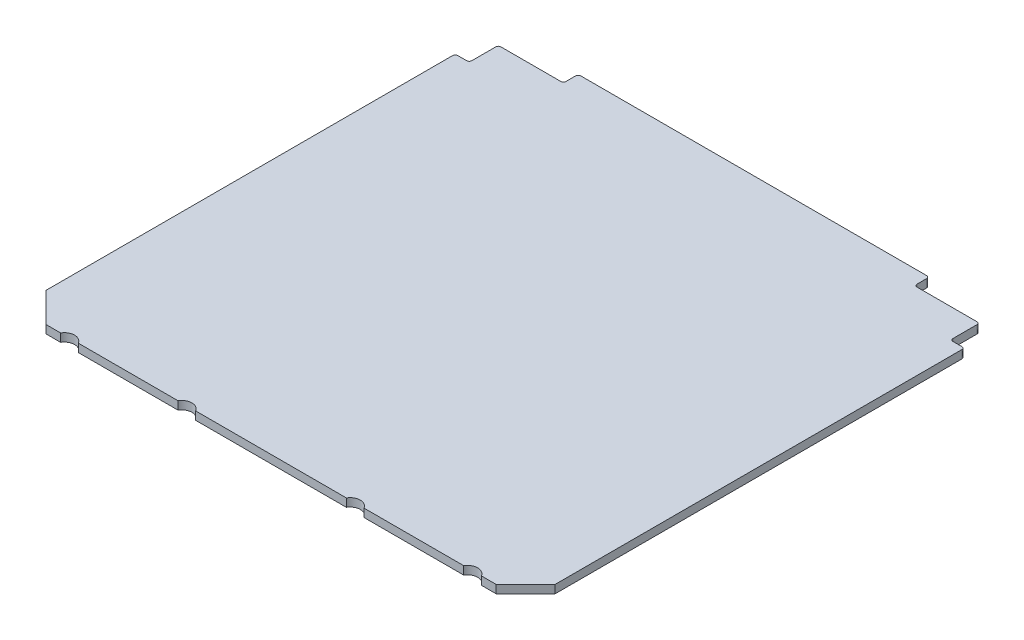
ISO-10303-21;
HEADER;
FILE_DESCRIPTION(('STEP AP214'),'2;1');
FILE_NAME('part.step','',(''),(''),'','','');
FILE_SCHEMA(('AUTOMOTIVE_DESIGN { 1 0 10303 214 1 1 1 1 }'));
ENDSEC;
DATA;
#1=APPLICATION_CONTEXT('core data for automotive mechanical design processes');
#2=APPLICATION_PROTOCOL_DEFINITION('international standard','automotive_design',2000,#1);
#3=PRODUCT_CONTEXT('',#1,'mechanical');
#4=PRODUCT('Part','Part','',(#3));
#5=PRODUCT_RELATED_PRODUCT_CATEGORY('part','',(#4));
#6=PRODUCT_DEFINITION_FORMATION('','',#4);
#7=PRODUCT_DEFINITION_CONTEXT('part definition',#1,'design');
#8=PRODUCT_DEFINITION('design','',#6,#7);
#9=PRODUCT_DEFINITION_SHAPE('','',#8);
#10=(LENGTH_UNIT() NAMED_UNIT(*) SI_UNIT(.MILLI.,.METRE.));
#11=(NAMED_UNIT(*) PLANE_ANGLE_UNIT() SI_UNIT($,.RADIAN.));
#12=(NAMED_UNIT(*) SI_UNIT($,.STERADIAN.) SOLID_ANGLE_UNIT());
#13=UNCERTAINTY_MEASURE_WITH_UNIT(LENGTH_MEASURE(1.E-05),#10,'distance_accuracy_value','');
#14=(GEOMETRIC_REPRESENTATION_CONTEXT(3) GLOBAL_UNCERTAINTY_ASSIGNED_CONTEXT((#13)) GLOBAL_UNIT_ASSIGNED_CONTEXT((#10,
#11,#12)) REPRESENTATION_CONTEXT('',''));
#15=CARTESIAN_POINT('',(0.,0.,0.));
#16=DIRECTION('',(0.,0.,1.));
#17=DIRECTION('',(1.,0.,0.));
#18=AXIS2_PLACEMENT_3D('',#15,#16,#17);
#19=CARTESIAN_POINT('',(-44.4499999999997,0.8,44.4500000000004));
#20=DIRECTION('',(0.707106781186542,0.,-0.707106781186553));
#21=DIRECTION('',(-0.707106781186553,0.,-0.707106781186542));
#22=AXIS2_PLACEMENT_3D('',#19,#20,#21);
#23=PLANE('',#22);
#24=DIRECTION('',(0.,1.,0.));
#25=VECTOR('',#24,1.);
#26=CARTESIAN_POINT('',(-44.1000000000001,-0.8,44.8));
#27=LINE('',#26,#25);
#28=CARTESIAN_POINT('',(-44.1000000000001,-0.8,44.8));
#29=VERTEX_POINT('',#28);
#30=CARTESIAN_POINT('',(-44.1000000000001,0.8,44.8));
#31=VERTEX_POINT('',#30);
#32=EDGE_CURVE('E249',#29,#31,#27,.T.);
#33=ORIENTED_EDGE('',*,*,#32,.T.);
#34=DIRECTION('',(0.707106781186553,0.,0.707106781186542));
#35=VECTOR('',#34,1.);
#36=CARTESIAN_POINT('',(-44.4499999999997,0.8,44.4500000000004));
#37=LINE('',#36,#35);
#38=CARTESIAN_POINT('',(-49.9000000000001,0.8,39.));
#39=VERTEX_POINT('',#38);
#40=EDGE_CURVE('E264',#39,#31,#37,.T.);
#41=ORIENTED_EDGE('',*,*,#40,.F.);
#42=DIRECTION('',(0.,1.,0.));
#43=VECTOR('',#42,1.);
#44=CARTESIAN_POINT('',(-49.9000000000001,-0.8,39.));
#45=LINE('',#44,#43);
#46=CARTESIAN_POINT('',(-49.9000000000001,-0.8,39.));
#47=VERTEX_POINT('',#46);
#48=EDGE_CURVE('E282',#47,#39,#45,.T.);
#49=ORIENTED_EDGE('',*,*,#48,.F.);
#50=DIRECTION('',(0.707106781186553,0.,0.707106781186542));
#51=VECTOR('',#50,1.);
#52=CARTESIAN_POINT('',(-44.4499999999997,-0.8,44.4500000000004));
#53=LINE('',#52,#51);
#54=EDGE_CURVE('E266',#47,#29,#53,.T.);
#55=ORIENTED_EDGE('',*,*,#54,.T.);
#56=EDGE_LOOP('',(#33,#41,#49,#55));
#57=FACE_BOUND('',#56,.T.);
#58=ADVANCED_FACE('F37',(#57),#23,.F.);
#59=CARTESIAN_POINT('',(44.4499999999995,0.8,44.4499999999995));
#60=DIRECTION('',(-0.707106781186548,0.,-0.707106781186548));
#61=DIRECTION('',(-0.707106781186548,0.,0.707106781186548));
#62=AXIS2_PLACEMENT_3D('',#59,#60,#61);
#63=PLANE('',#62);
#64=DIRECTION('',(0.,1.,0.));
#65=VECTOR('',#64,1.);
#66=CARTESIAN_POINT('',(44.0999999999991,-0.8,44.8));
#67=LINE('',#66,#65);
#68=CARTESIAN_POINT('',(44.0999999999991,-0.8,44.8));
#69=VERTEX_POINT('',#68);
#70=CARTESIAN_POINT('',(44.0999999999991,0.8,44.8));
#71=VERTEX_POINT('',#70);
#72=EDGE_CURVE('E267',#69,#71,#67,.T.);
#73=ORIENTED_EDGE('',*,*,#72,.F.);
#74=DIRECTION('',(0.707106781186548,0.,-0.707106781186548));
#75=VECTOR('',#74,1.);
#76=CARTESIAN_POINT('',(44.4499999999995,-0.8,44.4499999999995));
#77=LINE('',#76,#75);
#78=CARTESIAN_POINT('',(49.9000000000001,-0.8,38.999999999999));
#79=VERTEX_POINT('',#78);
#80=EDGE_CURVE('E276',#69,#79,#77,.T.);
#81=ORIENTED_EDGE('',*,*,#80,.T.);
#82=DIRECTION('',(0.,1.,0.));
#83=VECTOR('',#82,1.);
#84=CARTESIAN_POINT('',(49.9000000000001,-0.8,38.999999999999));
#85=LINE('',#84,#83);
#86=CARTESIAN_POINT('',(49.9000000000001,0.8,38.999999999999));
#87=VERTEX_POINT('',#86);
#88=EDGE_CURVE('E285',#79,#87,#85,.T.);
#89=ORIENTED_EDGE('',*,*,#88,.T.);
#90=DIRECTION('',(0.707106781186548,0.,-0.707106781186548));
#91=VECTOR('',#90,1.);
#92=CARTESIAN_POINT('',(44.4499999999995,0.8,44.4499999999995));
#93=LINE('',#92,#91);
#94=EDGE_CURVE('E275',#71,#87,#93,.T.);
#95=ORIENTED_EDGE('',*,*,#94,.F.);
#96=EDGE_LOOP('',(#73,#81,#89,#95));
#97=FACE_BOUND('',#96,.T.);
#98=ADVANCED_FACE('F561',(#97),#63,.F.);
#99=CARTESIAN_POINT('',(0.,0.8,0.));
#100=DIRECTION('',(0.,1.,0.));
#101=DIRECTION('',(0.,0.,1.));
#102=AXIS2_PLACEMENT_3D('',#99,#100,#101);
#103=PLANE('',#102);
#104=DIRECTION('',(0.,0.,-1.));
#105=VECTOR('',#104,1.);
#106=CARTESIAN_POINT('',(34.3999999999997,0.8,0.));
#107=LINE('',#106,#105);
#108=CARTESIAN_POINT('',(34.3999999999997,0.8,-47.4));
#109=VERTEX_POINT('',#108);
#110=CARTESIAN_POINT('',(34.3999999999997,0.8,-49.3));
#111=VERTEX_POINT('',#110);
#112=EDGE_CURVE('E410',#109,#111,#107,.T.);
#113=ORIENTED_EDGE('',*,*,#112,.T.);
#114=CARTESIAN_POINT('',(33.8999999999997,0.8,-49.3));
#115=DIRECTION('',(0.,1.,0.));
#116=DIRECTION('',(0.,0.,1.));
#117=AXIS2_PLACEMENT_3D('',#114,#115,#116);
#118=CIRCLE('',#117,0.5);
#119=CARTESIAN_POINT('',(33.8999999999997,0.8,-49.8));
#120=VERTEX_POINT('',#119);
#121=EDGE_CURVE('E352',#111,#120,#118,.T.);
#122=ORIENTED_EDGE('',*,*,#121,.T.);
#123=DIRECTION('',(1.,0.,0.));
#124=VECTOR('',#123,1.);
#125=CARTESIAN_POINT('',(-34.4000000000002,0.8,-49.8));
#126=LINE('',#125,#124);
#127=CARTESIAN_POINT('',(-33.9000000000002,0.8,-49.8));
#128=VERTEX_POINT('',#127);
#129=EDGE_CURVE('E507',#128,#120,#126,.T.);
#130=ORIENTED_EDGE('',*,*,#129,.F.);
#131=CARTESIAN_POINT('',(-33.9000000000002,0.8,-49.3));
#132=DIRECTION('',(0.,1.,0.));
#133=DIRECTION('',(0.,0.,1.));
#134=AXIS2_PLACEMENT_3D('',#131,#132,#133);
#135=CIRCLE('',#134,0.5);
#136=CARTESIAN_POINT('',(-34.4000000000002,0.8,-49.3));
#137=VERTEX_POINT('',#136);
#138=EDGE_CURVE('E346',#128,#137,#135,.T.);
#139=ORIENTED_EDGE('',*,*,#138,.T.);
#140=DIRECTION('',(0.,0.,1.));
#141=VECTOR('',#140,1.);
#142=CARTESIAN_POINT('',(-34.4000000000002,0.8,0.));
#143=LINE('',#142,#141);
#144=CARTESIAN_POINT('',(-34.4000000000002,0.8,-47.4));
#145=VERTEX_POINT('',#144);
#146=EDGE_CURVE('E476',#137,#145,#143,.T.);
#147=ORIENTED_EDGE('',*,*,#146,.T.);
#148=CARTESIAN_POINT('',(-34.9000000000002,0.8,-47.4));
#149=DIRECTION('',(0.,1.,0.));
#150=DIRECTION('',(0.,0.,1.));
#151=AXIS2_PLACEMENT_3D('',#148,#149,#150);
#152=CIRCLE('',#151,0.5);
#153=CARTESIAN_POINT('',(-34.9000000000002,0.8,-46.9));
#154=VERTEX_POINT('',#153);
#155=EDGE_CURVE('E338',#145,#154,#152,.F.);
#156=ORIENTED_EDGE('',*,*,#155,.T.);
#157=DIRECTION('',(-1.,0.,0.));
#158=VECTOR('',#157,1.);
#159=CARTESIAN_POINT('',(-47.1500000000002,0.8,-46.9));
#160=LINE('',#159,#158);
#161=CARTESIAN_POINT('',(-46.6500000000002,0.8,-46.9));
#162=VERTEX_POINT('',#161);
#163=EDGE_CURVE('E498',#154,#162,#160,.T.);
#164=ORIENTED_EDGE('',*,*,#163,.T.);
#165=CARTESIAN_POINT('',(-46.6500000000002,0.8,-46.4));
#166=DIRECTION('',(0.,1.,0.));
#167=DIRECTION('',(0.,0.,1.));
#168=AXIS2_PLACEMENT_3D('',#165,#166,#167);
#169=CIRCLE('',#168,0.5);
#170=CARTESIAN_POINT('',(-47.1500000000002,0.8,-46.4));
#171=VERTEX_POINT('',#170);
#172=EDGE_CURVE('E308',#162,#171,#169,.T.);
#173=ORIENTED_EDGE('',*,*,#172,.T.);
#174=DIRECTION('',(0.,0.,1.));
#175=VECTOR('',#174,1.);
#176=CARTESIAN_POINT('',(-47.1500000000002,0.8,0.));
#177=LINE('',#176,#175);
#178=CARTESIAN_POINT('',(-47.1500000000002,0.8,-41.7000000000001));
#179=VERTEX_POINT('',#178);
#180=EDGE_CURVE('E473',#171,#179,#177,.T.);
#181=ORIENTED_EDGE('',*,*,#180,.T.);
#182=CARTESIAN_POINT('',(-47.6500000000002,0.8,-41.7000000000001));
#183=DIRECTION('',(0.,1.,0.));
#184=DIRECTION('',(0.,0.,1.));
#185=AXIS2_PLACEMENT_3D('',#182,#183,#184);
#186=CIRCLE('',#185,0.5);
#187=CARTESIAN_POINT('',(-47.6500000000002,0.8,-41.2000000000001));
#188=VERTEX_POINT('',#187);
#189=EDGE_CURVE('E329',#179,#188,#186,.F.);
#190=ORIENTED_EDGE('',*,*,#189,.T.);
#191=DIRECTION('',(1.,0.,0.));
#192=VECTOR('',#191,1.);
#193=CARTESIAN_POINT('',(-49.9000000000001,0.8,-41.2000000000001));
#194=LINE('',#193,#192);
#195=CARTESIAN_POINT('',(-49.4000000000001,0.8,-41.2000000000001));
#196=VERTEX_POINT('',#195);
#197=EDGE_CURVE('E509',#196,#188,#194,.T.);
#198=ORIENTED_EDGE('',*,*,#197,.F.);
#199=CARTESIAN_POINT('',(-49.4000000000001,0.8,-40.7000000000001));
#200=DIRECTION('',(0.,1.,0.));
#201=DIRECTION('',(0.,0.,1.));
#202=AXIS2_PLACEMENT_3D('',#199,#200,#201);
#203=CIRCLE('',#202,0.5);
#204=CARTESIAN_POINT('',(-49.9000000000001,0.8,-40.7000000000001));
#205=VERTEX_POINT('',#204);
#206=EDGE_CURVE('E350',#196,#205,#203,.T.);
#207=ORIENTED_EDGE('',*,*,#206,.T.);
#208=DIRECTION('',(0.,0.,1.));
#209=VECTOR('',#208,1.);
#210=CARTESIAN_POINT('',(-49.9000000000001,0.8,0.));
#211=LINE('',#210,#209);
#212=EDGE_CURVE('E273',#205,#39,#211,.T.);
#213=ORIENTED_EDGE('',*,*,#212,.T.);
#214=ORIENTED_EDGE('',*,*,#40,.T.);
#215=DIRECTION('',(1.,0.,0.));
#216=VECTOR('',#215,1.);
#217=CARTESIAN_POINT('',(0.,0.8,44.8));
#218=LINE('',#217,#216);
#219=CARTESIAN_POINT('',(-41.2320508075689,0.8,44.8));
#220=VERTEX_POINT('',#219);
#221=EDGE_CURVE('E246',#31,#220,#218,.T.);
#222=ORIENTED_EDGE('',*,*,#221,.T.);
#223=CARTESIAN_POINT('',(-39.5,0.8,45.8));
#224=DIRECTION('',(0.,1.,0.));
#225=DIRECTION('',(0.,0.,1.));
#226=AXIS2_PLACEMENT_3D('',#223,#224,#225);
#227=CIRCLE('',#226,2.);
#228=CARTESIAN_POINT('',(-37.7679491924311,0.8,44.8));
#229=VERTEX_POINT('',#228);
#230=EDGE_CURVE('E433',#229,#220,#227,.T.);
#231=ORIENTED_EDGE('',*,*,#230,.F.);
#232=DIRECTION('',(1.,0.,0.));
#233=VECTOR('',#232,1.);
#234=CARTESIAN_POINT('',(0.,0.8,44.8));
#235=LINE('',#234,#233);
#236=CARTESIAN_POINT('',(-18.2320508075689,0.8,44.8));
#237=VERTEX_POINT('',#236);
#238=EDGE_CURVE('E437',#229,#237,#235,.T.);
#239=ORIENTED_EDGE('',*,*,#238,.T.);
#240=CARTESIAN_POINT('',(-16.5,0.8,45.8));
#241=DIRECTION('',(0.,1.,0.));
#242=DIRECTION('',(0.,0.,1.));
#243=AXIS2_PLACEMENT_3D('',#240,#241,#242);
#244=CIRCLE('',#243,2.);
#245=CARTESIAN_POINT('',(-14.7679491924311,0.8,44.8));
#246=VERTEX_POINT('',#245);
#247=EDGE_CURVE('E529',#246,#237,#244,.T.);
#248=ORIENTED_EDGE('',*,*,#247,.F.);
#249=DIRECTION('',(1.,0.,0.));
#250=VECTOR('',#249,1.);
#251=CARTESIAN_POINT('',(0.,0.8,44.8));
#252=LINE('',#251,#250);
#253=CARTESIAN_POINT('',(14.7679491924311,0.8,44.8));
#254=VERTEX_POINT('',#253);
#255=EDGE_CURVE('E526',#246,#254,#252,.T.);
#256=ORIENTED_EDGE('',*,*,#255,.T.);
#257=CARTESIAN_POINT('',(16.5,0.8,45.8));
#258=DIRECTION('',(0.,1.,0.));
#259=DIRECTION('',(0.,0.,1.));
#260=AXIS2_PLACEMENT_3D('',#257,#258,#259);
#261=CIRCLE('',#260,2.);
#262=CARTESIAN_POINT('',(18.2320508075689,0.8,44.8));
#263=VERTEX_POINT('',#262);
#264=EDGE_CURVE('E523',#263,#254,#261,.T.);
#265=ORIENTED_EDGE('',*,*,#264,.F.);
#266=DIRECTION('',(1.,0.,0.));
#267=VECTOR('',#266,1.);
#268=CARTESIAN_POINT('',(0.,0.8,44.8));
#269=LINE('',#268,#267);
#270=CARTESIAN_POINT('',(37.7679491924311,0.8,44.8));
#271=VERTEX_POINT('',#270);
#272=EDGE_CURVE('E520',#263,#271,#269,.T.);
#273=ORIENTED_EDGE('',*,*,#272,.T.);
#274=CARTESIAN_POINT('',(39.5,0.8,45.8));
#275=DIRECTION('',(0.,1.,0.));
#276=DIRECTION('',(0.,0.,1.));
#277=AXIS2_PLACEMENT_3D('',#274,#275,#276);
#278=CIRCLE('',#277,2.);
#279=CARTESIAN_POINT('',(41.2320508075689,0.8,44.8));
#280=VERTEX_POINT('',#279);
#281=EDGE_CURVE('E517',#280,#271,#278,.T.);
#282=ORIENTED_EDGE('',*,*,#281,.F.);
#283=DIRECTION('',(1.,0.,0.));
#284=VECTOR('',#283,1.);
#285=CARTESIAN_POINT('',(0.,0.8,44.8));
#286=LINE('',#285,#284);
#287=EDGE_CURVE('E257',#280,#71,#286,.T.);
#288=ORIENTED_EDGE('',*,*,#287,.T.);
#289=ORIENTED_EDGE('',*,*,#94,.T.);
#290=DIRECTION('',(0.,0.,-1.));
#291=VECTOR('',#290,1.);
#292=CARTESIAN_POINT('',(49.9000000000001,0.8,0.));
#293=LINE('',#292,#291);
#294=CARTESIAN_POINT('',(49.9000000000001,0.8,-40.7000000000001));
#295=VERTEX_POINT('',#294);
#296=EDGE_CURVE('E399',#87,#295,#293,.T.);
#297=ORIENTED_EDGE('',*,*,#296,.T.);
#298=CARTESIAN_POINT('',(49.4000000000001,0.8,-40.7000000000001));
#299=DIRECTION('',(0.,1.,0.));
#300=DIRECTION('',(0.,0.,1.));
#301=AXIS2_PLACEMENT_3D('',#298,#299,#300);
#302=CIRCLE('',#301,0.5);
#303=CARTESIAN_POINT('',(49.4000000000001,0.8,-41.2000000000001));
#304=VERTEX_POINT('',#303);
#305=EDGE_CURVE('E348',#295,#304,#302,.T.);
#306=ORIENTED_EDGE('',*,*,#305,.T.);
#307=DIRECTION('',(1.,0.,0.));
#308=VECTOR('',#307,1.);
#309=CARTESIAN_POINT('',(49.9000000000001,0.8,-41.2000000000001));
#310=LINE('',#309,#308);
#311=CARTESIAN_POINT('',(47.6499999999999,0.8,-41.2000000000001));
#312=VERTEX_POINT('',#311);
#313=EDGE_CURVE('E380',#312,#304,#310,.T.);
#314=ORIENTED_EDGE('',*,*,#313,.F.);
#315=CARTESIAN_POINT('',(47.6499999999999,0.8,-41.7000000000001));
#316=DIRECTION('',(0.,1.,0.));
#317=DIRECTION('',(0.,0.,1.));
#318=AXIS2_PLACEMENT_3D('',#315,#316,#317);
#319=CIRCLE('',#318,0.5);
#320=CARTESIAN_POINT('',(47.1499999999999,0.8,-41.7000000000001));
#321=VERTEX_POINT('',#320);
#322=EDGE_CURVE('E324',#312,#321,#319,.F.);
#323=ORIENTED_EDGE('',*,*,#322,.T.);
#324=DIRECTION('',(0.,0.,-1.));
#325=VECTOR('',#324,1.);
#326=CARTESIAN_POINT('',(47.1499999999999,0.8,0.));
#327=LINE('',#326,#325);
#328=CARTESIAN_POINT('',(47.1499999999999,0.8,-46.4));
#329=VERTEX_POINT('',#328);
#330=EDGE_CURVE('E405',#321,#329,#327,.T.);
#331=ORIENTED_EDGE('',*,*,#330,.T.);
#332=CARTESIAN_POINT('',(46.6499999999999,0.8,-46.4));
#333=DIRECTION('',(0.,1.,0.));
#334=DIRECTION('',(0.,0.,1.));
#335=AXIS2_PLACEMENT_3D('',#332,#333,#334);
#336=CIRCLE('',#335,0.5);
#337=CARTESIAN_POINT('',(46.6499999999999,0.8,-46.9));
#338=VERTEX_POINT('',#337);
#339=EDGE_CURVE('E310',#329,#338,#336,.T.);
#340=ORIENTED_EDGE('',*,*,#339,.T.);
#341=DIRECTION('',(-1.,0.,0.));
#342=VECTOR('',#341,1.);
#343=CARTESIAN_POINT('',(34.3999999999997,0.8,-46.9));
#344=LINE('',#343,#342);
#345=CARTESIAN_POINT('',(34.8999999999997,0.8,-46.9));
#346=VERTEX_POINT('',#345);
#347=EDGE_CURVE('E499',#338,#346,#344,.T.);
#348=ORIENTED_EDGE('',*,*,#347,.T.);
#349=CARTESIAN_POINT('',(34.8999999999997,0.8,-47.4));
#350=DIRECTION('',(0.,1.,0.));
#351=DIRECTION('',(0.,0.,1.));
#352=AXIS2_PLACEMENT_3D('',#349,#350,#351);
#353=CIRCLE('',#352,0.5);
#354=EDGE_CURVE('E334',#346,#109,#353,.F.);
#355=ORIENTED_EDGE('',*,*,#354,.T.);
#356=EDGE_LOOP('',(#113,#122,#130,#139,#147,#156,#164,#173,#181,#190,#198,#207,#213,#214,#222,
#231,#239,#248,#256,#265,#273,#282,#288,#289,#297,#306,#314,#323,#331,#340,#348,#355));
#357=FACE_BOUND('',#356,.T.);
#358=ADVANCED_FACE('F271',(#357),#103,.T.);
#359=CARTESIAN_POINT('',(0.,-0.8,0.));
#360=DIRECTION('',(0.,1.,0.));
#361=DIRECTION('',(0.,0.,1.));
#362=AXIS2_PLACEMENT_3D('',#359,#360,#361);
#363=PLANE('',#362);
#364=DIRECTION('',(-1.,0.,0.));
#365=VECTOR('',#364,1.);
#366=CARTESIAN_POINT('',(-34.4000000000002,-0.8,-49.8));
#367=LINE('',#366,#365);
#368=CARTESIAN_POINT('',(33.8999999999997,-0.8,-49.8));
#369=VERTEX_POINT('',#368);
#370=CARTESIAN_POINT('',(-33.9000000000002,-0.8,-49.8));
#371=VERTEX_POINT('',#370);
#372=EDGE_CURVE('E390',#369,#371,#367,.T.);
#373=ORIENTED_EDGE('',*,*,#372,.F.);
#374=CARTESIAN_POINT('',(33.8999999999997,-0.8,-49.3));
#375=DIRECTION('',(0.,1.,0.));
#376=DIRECTION('',(0.,0.,1.));
#377=AXIS2_PLACEMENT_3D('',#374,#375,#376);
#378=CIRCLE('',#377,0.5);
#379=CARTESIAN_POINT('',(34.3999999999997,-0.8,-49.3));
#380=VERTEX_POINT('',#379);
#381=EDGE_CURVE('E364',#369,#380,#378,.F.);
#382=ORIENTED_EDGE('',*,*,#381,.T.);
#383=DIRECTION('',(0.,0.,-1.));
#384=VECTOR('',#383,1.);
#385=CARTESIAN_POINT('',(34.3999999999997,-0.8,0.));
#386=LINE('',#385,#384);
#387=CARTESIAN_POINT('',(34.3999999999997,-0.8,-47.4));
#388=VERTEX_POINT('',#387);
#389=EDGE_CURVE('E418',#388,#380,#386,.T.);
#390=ORIENTED_EDGE('',*,*,#389,.F.);
#391=CARTESIAN_POINT('',(34.8999999999997,-0.8,-47.4));
#392=DIRECTION('',(0.,1.,0.));
#393=DIRECTION('',(0.,0.,1.));
#394=AXIS2_PLACEMENT_3D('',#391,#392,#393);
#395=CIRCLE('',#394,0.5);
#396=CARTESIAN_POINT('',(34.8999999999997,-0.8,-46.9));
#397=VERTEX_POINT('',#396);
#398=EDGE_CURVE('E336',#388,#397,#395,.T.);
#399=ORIENTED_EDGE('',*,*,#398,.T.);
#400=DIRECTION('',(1.,0.,0.));
#401=VECTOR('',#400,1.);
#402=CARTESIAN_POINT('',(34.3999999999997,-0.8,-46.9));
#403=LINE('',#402,#401);
#404=CARTESIAN_POINT('',(46.6499999999999,-0.8,-46.9));
#405=VERTEX_POINT('',#404);
#406=EDGE_CURVE('E492',#397,#405,#403,.T.);
#407=ORIENTED_EDGE('',*,*,#406,.T.);
#408=CARTESIAN_POINT('',(46.6499999999999,-0.8,-46.4));
#409=DIRECTION('',(0.,1.,0.));
#410=DIRECTION('',(0.,0.,1.));
#411=AXIS2_PLACEMENT_3D('',#408,#409,#410);
#412=CIRCLE('',#411,0.5);
#413=CARTESIAN_POINT('',(47.1499999999999,-0.8,-46.4));
#414=VERTEX_POINT('',#413);
#415=EDGE_CURVE('E314',#405,#414,#412,.F.);
#416=ORIENTED_EDGE('',*,*,#415,.T.);
#417=DIRECTION('',(0.,0.,-1.));
#418=VECTOR('',#417,1.);
#419=CARTESIAN_POINT('',(47.1499999999999,-0.8,0.));
#420=LINE('',#419,#418);
#421=CARTESIAN_POINT('',(47.1499999999999,-0.8,-41.7000000000001));
#422=VERTEX_POINT('',#421);
#423=EDGE_CURVE('E421',#422,#414,#420,.T.);
#424=ORIENTED_EDGE('',*,*,#423,.F.);
#425=CARTESIAN_POINT('',(47.6499999999999,-0.8,-41.7000000000001));
#426=DIRECTION('',(0.,1.,0.));
#427=DIRECTION('',(0.,0.,1.));
#428=AXIS2_PLACEMENT_3D('',#425,#426,#427);
#429=CIRCLE('',#428,0.5);
#430=CARTESIAN_POINT('',(47.6499999999999,-0.8,-41.2000000000001));
#431=VERTEX_POINT('',#430);
#432=EDGE_CURVE('E326',#422,#431,#429,.T.);
#433=ORIENTED_EDGE('',*,*,#432,.T.);
#434=DIRECTION('',(-1.,0.,0.));
#435=VECTOR('',#434,1.);
#436=CARTESIAN_POINT('',(49.9000000000001,-0.8,-41.2000000000001));
#437=LINE('',#436,#435);
#438=CARTESIAN_POINT('',(49.4000000000001,-0.8,-41.2000000000001));
#439=VERTEX_POINT('',#438);
#440=EDGE_CURVE('E378',#439,#431,#437,.T.);
#441=ORIENTED_EDGE('',*,*,#440,.F.);
#442=CARTESIAN_POINT('',(49.4000000000001,-0.8,-40.7000000000001));
#443=DIRECTION('',(0.,1.,0.));
#444=DIRECTION('',(0.,0.,1.));
#445=AXIS2_PLACEMENT_3D('',#442,#443,#444);
#446=CIRCLE('',#445,0.5);
#447=CARTESIAN_POINT('',(49.9000000000001,-0.8,-40.7000000000001));
#448=VERTEX_POINT('',#447);
#449=EDGE_CURVE('E361',#439,#448,#446,.F.);
#450=ORIENTED_EDGE('',*,*,#449,.T.);
#451=DIRECTION('',(0.,0.,-1.));
#452=VECTOR('',#451,1.);
#453=CARTESIAN_POINT('',(49.9000000000001,-0.8,0.));
#454=LINE('',#453,#452);
#455=EDGE_CURVE('E401',#79,#448,#454,.T.);
#456=ORIENTED_EDGE('',*,*,#455,.F.);
#457=ORIENTED_EDGE('',*,*,#80,.F.);
#458=DIRECTION('',(1.,0.,0.));
#459=VECTOR('',#458,1.);
#460=CARTESIAN_POINT('',(0.,-0.8,44.8));
#461=LINE('',#460,#459);
#462=CARTESIAN_POINT('',(41.2320508075689,-0.8,44.8));
#463=VERTEX_POINT('',#462);
#464=EDGE_CURVE('E432',#463,#69,#461,.T.);
#465=ORIENTED_EDGE('',*,*,#464,.F.);
#466=CARTESIAN_POINT('',(39.5,-0.8,45.8));
#467=DIRECTION('',(0.,1.,0.));
#468=DIRECTION('',(0.,0.,1.));
#469=AXIS2_PLACEMENT_3D('',#466,#467,#468);
#470=CIRCLE('',#469,2.);
#471=CARTESIAN_POINT('',(37.7679491924311,-0.8,44.8));
#472=VERTEX_POINT('',#471);
#473=EDGE_CURVE('E435',#463,#472,#470,.T.);
#474=ORIENTED_EDGE('',*,*,#473,.T.);
#475=DIRECTION('',(1.,0.,0.));
#476=VECTOR('',#475,1.);
#477=CARTESIAN_POINT('',(0.,-0.8,44.8));
#478=LINE('',#477,#476);
#479=CARTESIAN_POINT('',(18.2320508075689,-0.8,44.8));
#480=VERTEX_POINT('',#479);
#481=EDGE_CURVE('E443',#480,#472,#478,.T.);
#482=ORIENTED_EDGE('',*,*,#481,.F.);
#483=CARTESIAN_POINT('',(16.5,-0.8,45.8));
#484=DIRECTION('',(0.,1.,0.));
#485=DIRECTION('',(0.,0.,1.));
#486=AXIS2_PLACEMENT_3D('',#483,#484,#485);
#487=CIRCLE('',#486,2.);
#488=CARTESIAN_POINT('',(14.7679491924311,-0.8,44.8));
#489=VERTEX_POINT('',#488);
#490=EDGE_CURVE('E445',#480,#489,#487,.T.);
#491=ORIENTED_EDGE('',*,*,#490,.T.);
#492=DIRECTION('',(1.,0.,0.));
#493=VECTOR('',#492,1.);
#494=CARTESIAN_POINT('',(0.,-0.8,44.8));
#495=LINE('',#494,#493);
#496=CARTESIAN_POINT('',(-14.7679491924311,-0.8,44.8));
#497=VERTEX_POINT('',#496);
#498=EDGE_CURVE('E448',#497,#489,#495,.T.);
#499=ORIENTED_EDGE('',*,*,#498,.F.);
#500=CARTESIAN_POINT('',(-16.5,-0.8,45.8));
#501=DIRECTION('',(0.,1.,0.));
#502=DIRECTION('',(0.,0.,1.));
#503=AXIS2_PLACEMENT_3D('',#500,#501,#502);
#504=CIRCLE('',#503,2.);
#505=CARTESIAN_POINT('',(-18.2320508075689,-0.8,44.8));
#506=VERTEX_POINT('',#505);
#507=EDGE_CURVE('E450',#497,#506,#504,.T.);
#508=ORIENTED_EDGE('',*,*,#507,.T.);
#509=DIRECTION('',(1.,0.,0.));
#510=VECTOR('',#509,1.);
#511=CARTESIAN_POINT('',(0.,-0.8,44.8));
#512=LINE('',#511,#510);
#513=CARTESIAN_POINT('',(-37.7679491924311,-0.8,44.8));
#514=VERTEX_POINT('',#513);
#515=EDGE_CURVE('E453',#514,#506,#512,.T.);
#516=ORIENTED_EDGE('',*,*,#515,.F.);
#517=CARTESIAN_POINT('',(-39.5,-0.8,45.8));
#518=DIRECTION('',(0.,1.,0.));
#519=DIRECTION('',(0.,0.,1.));
#520=AXIS2_PLACEMENT_3D('',#517,#518,#519);
#521=CIRCLE('',#520,2.);
#522=CARTESIAN_POINT('',(-41.2320508075689,-0.8,44.8));
#523=VERTEX_POINT('',#522);
#524=EDGE_CURVE('E268',#514,#523,#521,.T.);
#525=ORIENTED_EDGE('',*,*,#524,.T.);
#526=DIRECTION('',(1.,0.,0.));
#527=VECTOR('',#526,1.);
#528=CARTESIAN_POINT('',(0.,-0.8,44.8));
#529=LINE('',#528,#527);
#530=EDGE_CURVE('E429',#29,#523,#529,.T.);
#531=ORIENTED_EDGE('',*,*,#530,.F.);
#532=ORIENTED_EDGE('',*,*,#54,.F.);
#533=DIRECTION('',(0.,0.,1.));
#534=VECTOR('',#533,1.);
#535=CARTESIAN_POINT('',(-49.9000000000001,-0.8,0.));
#536=LINE('',#535,#534);
#537=CARTESIAN_POINT('',(-49.9000000000001,-0.8,-40.7000000000001));
#538=VERTEX_POINT('',#537);
#539=EDGE_CURVE('E404',#538,#47,#536,.T.);
#540=ORIENTED_EDGE('',*,*,#539,.F.);
#541=CARTESIAN_POINT('',(-49.4000000000001,-0.8,-40.7000000000001));
#542=DIRECTION('',(0.,1.,0.));
#543=DIRECTION('',(0.,0.,1.));
#544=AXIS2_PLACEMENT_3D('',#541,#542,#543);
#545=CIRCLE('',#544,0.5);
#546=CARTESIAN_POINT('',(-49.4000000000001,-0.8,-41.2000000000001));
#547=VERTEX_POINT('',#546);
#548=EDGE_CURVE('E58',#538,#547,#545,.F.);
#549=ORIENTED_EDGE('',*,*,#548,.T.);
#550=DIRECTION('',(-1.,0.,0.));
#551=VECTOR('',#550,1.);
#552=CARTESIAN_POINT('',(-49.9000000000001,-0.8,-41.2000000000001));
#553=LINE('',#552,#551);
#554=CARTESIAN_POINT('',(-47.6500000000002,-0.8,-41.2000000000001));
#555=VERTEX_POINT('',#554);
#556=EDGE_CURVE('E258',#555,#547,#553,.T.);
#557=ORIENTED_EDGE('',*,*,#556,.F.);
#558=CARTESIAN_POINT('',(-47.6500000000002,-0.8,-41.7000000000001));
#559=DIRECTION('',(0.,1.,0.));
#560=DIRECTION('',(0.,0.,1.));
#561=AXIS2_PLACEMENT_3D('',#558,#559,#560);
#562=CIRCLE('',#561,0.5);
#563=CARTESIAN_POINT('',(-47.1500000000002,-0.8,-41.7000000000001));
#564=VERTEX_POINT('',#563);
#565=EDGE_CURVE('E332',#555,#564,#562,.T.);
#566=ORIENTED_EDGE('',*,*,#565,.T.);
#567=DIRECTION('',(0.,0.,1.));
#568=VECTOR('',#567,1.);
#569=CARTESIAN_POINT('',(-47.1500000000002,-0.8,0.));
#570=LINE('',#569,#568);
#571=CARTESIAN_POINT('',(-47.1500000000002,-0.8,-46.4));
#572=VERTEX_POINT('',#571);
#573=EDGE_CURVE('E407',#572,#564,#570,.T.);
#574=ORIENTED_EDGE('',*,*,#573,.F.);
#575=CARTESIAN_POINT('',(-46.6500000000002,-0.8,-46.4));
#576=DIRECTION('',(0.,1.,0.));
#577=DIRECTION('',(0.,0.,1.));
#578=AXIS2_PLACEMENT_3D('',#575,#576,#577);
#579=CIRCLE('',#578,0.5);
#580=CARTESIAN_POINT('',(-46.6500000000002,-0.8,-46.9));
#581=VERTEX_POINT('',#580);
#582=EDGE_CURVE('E312',#572,#581,#579,.F.);
#583=ORIENTED_EDGE('',*,*,#582,.T.);
#584=DIRECTION('',(1.,0.,0.));
#585=VECTOR('',#584,1.);
#586=CARTESIAN_POINT('',(-47.1500000000002,-0.8,-46.9));
#587=LINE('',#586,#585);
#588=CARTESIAN_POINT('',(-34.9000000000002,-0.8,-46.9));
#589=VERTEX_POINT('',#588);
#590=EDGE_CURVE('E502',#581,#589,#587,.T.);
#591=ORIENTED_EDGE('',*,*,#590,.T.);
#592=CARTESIAN_POINT('',(-34.9000000000002,-0.8,-47.4));
#593=DIRECTION('',(0.,1.,0.));
#594=DIRECTION('',(0.,0.,1.));
#595=AXIS2_PLACEMENT_3D('',#592,#593,#594);
#596=CIRCLE('',#595,0.5);
#597=CARTESIAN_POINT('',(-34.4000000000002,-0.8,-47.4));
#598=VERTEX_POINT('',#597);
#599=EDGE_CURVE('E340',#589,#598,#596,.T.);
#600=ORIENTED_EDGE('',*,*,#599,.T.);
#601=DIRECTION('',(0.,0.,1.));
#602=VECTOR('',#601,1.);
#603=CARTESIAN_POINT('',(-34.4000000000002,-0.8,0.));
#604=LINE('',#603,#602);
#605=CARTESIAN_POINT('',(-34.4000000000002,-0.8,-49.3));
#606=VERTEX_POINT('',#605);
#607=EDGE_CURVE('E416',#606,#598,#604,.T.);
#608=ORIENTED_EDGE('',*,*,#607,.F.);
#609=CARTESIAN_POINT('',(-33.9000000000002,-0.8,-49.3));
#610=DIRECTION('',(0.,1.,0.));
#611=DIRECTION('',(0.,0.,1.));
#612=AXIS2_PLACEMENT_3D('',#609,#610,#611);
#613=CIRCLE('',#612,0.5);
#614=EDGE_CURVE('E359',#606,#371,#613,.F.);
#615=ORIENTED_EDGE('',*,*,#614,.T.);
#616=EDGE_LOOP('',(#373,#382,#390,#399,#407,#416,#424,#433,#441,#450,#456,#457,#465,#474,#482,
#491,#499,#508,#516,#525,#531,#532,#540,#549,#557,#566,#574,#583,#591,#600,#608,#615));
#617=FACE_BOUND('',#616,.T.);
#618=ADVANCED_FACE('F384',(#617),#363,.F.);
#619=CARTESIAN_POINT('',(49.9000000000001,-0.8,0.));
#620=DIRECTION('',(1.,0.,0.));
#621=DIRECTION('',(0.,0.,-1.));
#622=AXIS2_PLACEMENT_3D('',#619,#620,#621);
#623=PLANE('',#622);
#624=ORIENTED_EDGE('',*,*,#455,.T.);
#625=DIRECTION('',(0.,1.,0.));
#626=VECTOR('',#625,1.);
#627=CARTESIAN_POINT('',(49.9000000000001,0.8,-40.7000000000001));
#628=LINE('',#627,#626);
#629=EDGE_CURVE('E371',#448,#295,#628,.T.);
#630=ORIENTED_EDGE('',*,*,#629,.T.);
#631=ORIENTED_EDGE('',*,*,#296,.F.);
#632=ORIENTED_EDGE('',*,*,#88,.F.);
#633=EDGE_LOOP('',(#624,#630,#631,#632));
#634=FACE_BOUND('',#633,.T.);
#635=ADVANCED_FACE('F397',(#634),#623,.T.);
#636=CARTESIAN_POINT('',(47.1499999999999,-0.8,0.));
#637=DIRECTION('',(1.,0.,0.));
#638=DIRECTION('',(0.,0.,-1.));
#639=AXIS2_PLACEMENT_3D('',#636,#637,#638);
#640=PLANE('',#639);
#641=ORIENTED_EDGE('',*,*,#330,.F.);
#642=DIRECTION('',(0.,1.,0.));
#643=VECTOR('',#642,1.);
#644=CARTESIAN_POINT('',(47.1499999999999,-0.8,-41.7000000000001));
#645=LINE('',#644,#643);
#646=EDGE_CURVE('E292',#321,#422,#645,.F.);
#647=ORIENTED_EDGE('',*,*,#646,.T.);
#648=ORIENTED_EDGE('',*,*,#423,.T.);
#649=DIRECTION('',(0.,1.,0.));
#650=VECTOR('',#649,1.);
#651=CARTESIAN_POINT('',(47.1499999999999,-0.8,-46.4));
#652=LINE('',#651,#650);
#653=EDGE_CURVE('E289',#414,#329,#652,.T.);
#654=ORIENTED_EDGE('',*,*,#653,.T.);
#655=EDGE_LOOP('',(#641,#647,#648,#654));
#656=FACE_BOUND('',#655,.T.);
#657=ADVANCED_FACE('F662',(#656),#640,.T.);
#658=CARTESIAN_POINT('',(34.3999999999997,-0.8,0.));
#659=DIRECTION('',(1.,0.,0.));
#660=DIRECTION('',(0.,0.,-1.));
#661=AXIS2_PLACEMENT_3D('',#658,#659,#660);
#662=PLANE('',#661);
#663=ORIENTED_EDGE('',*,*,#389,.T.);
#664=DIRECTION('',(0.,1.,0.));
#665=VECTOR('',#664,1.);
#666=CARTESIAN_POINT('',(34.3999999999997,0.8,-49.3));
#667=LINE('',#666,#665);
#668=EDGE_CURVE('E343',#380,#111,#667,.T.);
#669=ORIENTED_EDGE('',*,*,#668,.T.);
#670=ORIENTED_EDGE('',*,*,#112,.F.);
#671=DIRECTION('',(0.,1.,0.));
#672=VECTOR('',#671,1.);
#673=CARTESIAN_POINT('',(34.3999999999997,-0.8,-47.4));
#674=LINE('',#673,#672);
#675=EDGE_CURVE('E306',#109,#388,#674,.F.);
#676=ORIENTED_EDGE('',*,*,#675,.T.);
#677=EDGE_LOOP('',(#663,#669,#670,#676));
#678=FACE_BOUND('',#677,.T.);
#679=ADVANCED_FACE('F483',(#678),#662,.T.);
#680=CARTESIAN_POINT('',(-34.4000000000002,-0.8,0.));
#681=DIRECTION('',(-1.,0.,0.));
#682=DIRECTION('',(0.,0.,1.));
#683=AXIS2_PLACEMENT_3D('',#680,#681,#682);
#684=PLANE('',#683);
#685=ORIENTED_EDGE('',*,*,#146,.F.);
#686=DIRECTION('',(0.,1.,0.));
#687=VECTOR('',#686,1.);
#688=CARTESIAN_POINT('',(-34.4000000000002,-0.8,-49.3));
#689=LINE('',#688,#687);
#690=EDGE_CURVE('E11',#137,#606,#689,.F.);
#691=ORIENTED_EDGE('',*,*,#690,.T.);
#692=ORIENTED_EDGE('',*,*,#607,.T.);
#693=DIRECTION('',(0.,1.,0.));
#694=VECTOR('',#693,1.);
#695=CARTESIAN_POINT('',(-34.4000000000002,0.8,-47.4));
#696=LINE('',#695,#694);
#697=EDGE_CURVE('E316',#598,#145,#696,.T.);
#698=ORIENTED_EDGE('',*,*,#697,.T.);
#699=EDGE_LOOP('',(#685,#691,#692,#698));
#700=FACE_BOUND('',#699,.T.);
#701=ADVANCED_FACE('F627',(#700),#684,.T.);
#702=CARTESIAN_POINT('',(-47.1500000000002,-0.8,0.));
#703=DIRECTION('',(-1.,0.,0.));
#704=DIRECTION('',(0.,0.,1.));
#705=AXIS2_PLACEMENT_3D('',#702,#703,#704);
#706=PLANE('',#705);
#707=ORIENTED_EDGE('',*,*,#573,.T.);
#708=DIRECTION('',(0.,1.,0.));
#709=VECTOR('',#708,1.);
#710=CARTESIAN_POINT('',(-47.1500000000002,-0.8,-41.7000000000001));
#711=LINE('',#710,#709);
#712=EDGE_CURVE('E296',#564,#179,#711,.T.);
#713=ORIENTED_EDGE('',*,*,#712,.T.);
#714=ORIENTED_EDGE('',*,*,#180,.F.);
#715=DIRECTION('',(0.,1.,0.));
#716=VECTOR('',#715,1.);
#717=CARTESIAN_POINT('',(-47.1500000000002,-0.8,-46.4));
#718=LINE('',#717,#716);
#719=EDGE_CURVE('E294',#171,#572,#718,.F.);
#720=ORIENTED_EDGE('',*,*,#719,.T.);
#721=EDGE_LOOP('',(#707,#713,#714,#720));
#722=FACE_BOUND('',#721,.T.);
#723=ADVANCED_FACE('F640',(#722),#706,.T.);
#724=CARTESIAN_POINT('',(-49.9000000000001,-0.8,0.));
#725=DIRECTION('',(-1.,0.,0.));
#726=DIRECTION('',(0.,0.,1.));
#727=AXIS2_PLACEMENT_3D('',#724,#725,#726);
#728=PLANE('',#727);
#729=ORIENTED_EDGE('',*,*,#212,.F.);
#730=DIRECTION('',(0.,1.,0.));
#731=VECTOR('',#730,1.);
#732=CARTESIAN_POINT('',(-49.9000000000001,-0.8,-40.7000000000001));
#733=LINE('',#732,#731);
#734=EDGE_CURVE('E369',#205,#538,#733,.F.);
#735=ORIENTED_EDGE('',*,*,#734,.T.);
#736=ORIENTED_EDGE('',*,*,#539,.T.);
#737=ORIENTED_EDGE('',*,*,#48,.T.);
#738=EDGE_LOOP('',(#729,#735,#736,#737));
#739=FACE_BOUND('',#738,.T.);
#740=ADVANCED_FACE('F426',(#739),#728,.T.);
#741=CARTESIAN_POINT('',(0.,-0.8,44.8));
#742=DIRECTION('',(0.,0.,1.));
#743=DIRECTION('',(1.,0.,0.));
#744=AXIS2_PLACEMENT_3D('',#741,#742,#743);
#745=PLANE('',#744);
#746=ORIENTED_EDGE('',*,*,#32,.F.);
#747=ORIENTED_EDGE('',*,*,#530,.T.);
#748=DIRECTION('',(0.,1.,0.));
#749=VECTOR('',#748,1.);
#750=CARTESIAN_POINT('',(-41.2320508075689,-0.8,44.8));
#751=LINE('',#750,#749);
#752=EDGE_CURVE('E252',#523,#220,#751,.T.);
#753=ORIENTED_EDGE('',*,*,#752,.T.);
#754=ORIENTED_EDGE('',*,*,#221,.F.);
#755=EDGE_LOOP('',(#746,#747,#753,#754));
#756=FACE_BOUND('',#755,.T.);
#757=ADVANCED_FACE('F248',(#756),#745,.T.);
#758=CARTESIAN_POINT('',(-39.5,-0.8,45.8));
#759=DIRECTION('',(0.,1.,0.));
#760=DIRECTION('',(0.,0.,1.));
#761=AXIS2_PLACEMENT_3D('',#758,#759,#760);
#762=CYLINDRICAL_SURFACE('',#761,2.);
#763=ORIENTED_EDGE('',*,*,#752,.F.);
#764=ORIENTED_EDGE('',*,*,#524,.F.);
#765=DIRECTION('',(0.,1.,0.));
#766=VECTOR('',#765,1.);
#767=CARTESIAN_POINT('',(-37.7679491924311,-0.8,44.8));
#768=LINE('',#767,#766);
#769=EDGE_CURVE('E457',#514,#229,#768,.T.);
#770=ORIENTED_EDGE('',*,*,#769,.T.);
#771=ORIENTED_EDGE('',*,*,#230,.T.);
#772=EDGE_LOOP('',(#763,#764,#770,#771));
#773=FACE_BOUND('',#772,.T.);
#774=ADVANCED_FACE('F707',(#773),#762,.F.);
#775=CARTESIAN_POINT('',(0.,-0.8,44.8));
#776=DIRECTION('',(0.,0.,1.));
#777=DIRECTION('',(1.,0.,0.));
#778=AXIS2_PLACEMENT_3D('',#775,#776,#777);
#779=PLANE('',#778);
#780=ORIENTED_EDGE('',*,*,#769,.F.);
#781=ORIENTED_EDGE('',*,*,#515,.T.);
#782=DIRECTION('',(0.,1.,0.));
#783=VECTOR('',#782,1.);
#784=CARTESIAN_POINT('',(-18.2320508075689,-0.8,44.8));
#785=LINE('',#784,#783);
#786=EDGE_CURVE('E459',#506,#237,#785,.T.);
#787=ORIENTED_EDGE('',*,*,#786,.T.);
#788=ORIENTED_EDGE('',*,*,#238,.F.);
#789=EDGE_LOOP('',(#780,#781,#787,#788));
#790=FACE_BOUND('',#789,.T.);
#791=ADVANCED_FACE('F535',(#790),#779,.T.);
#792=CARTESIAN_POINT('',(-16.5,-0.8,45.8));
#793=DIRECTION('',(0.,1.,0.));
#794=DIRECTION('',(0.,0.,1.));
#795=AXIS2_PLACEMENT_3D('',#792,#793,#794);
#796=CYLINDRICAL_SURFACE('',#795,2.);
#797=ORIENTED_EDGE('',*,*,#786,.F.);
#798=ORIENTED_EDGE('',*,*,#507,.F.);
#799=DIRECTION('',(0.,1.,0.));
#800=VECTOR('',#799,1.);
#801=CARTESIAN_POINT('',(-14.7679491924311,-0.8,44.8));
#802=LINE('',#801,#800);
#803=EDGE_CURVE('E461',#497,#246,#802,.T.);
#804=ORIENTED_EDGE('',*,*,#803,.T.);
#805=ORIENTED_EDGE('',*,*,#247,.T.);
#806=EDGE_LOOP('',(#797,#798,#804,#805));
#807=FACE_BOUND('',#806,.T.);
#808=ADVANCED_FACE('F539',(#807),#796,.F.);
#809=CARTESIAN_POINT('',(0.,-0.8,44.8));
#810=DIRECTION('',(0.,0.,1.));
#811=DIRECTION('',(1.,0.,0.));
#812=AXIS2_PLACEMENT_3D('',#809,#810,#811);
#813=PLANE('',#812);
#814=ORIENTED_EDGE('',*,*,#803,.F.);
#815=ORIENTED_EDGE('',*,*,#498,.T.);
#816=DIRECTION('',(0.,1.,0.));
#817=VECTOR('',#816,1.);
#818=CARTESIAN_POINT('',(14.7679491924311,-0.8,44.8));
#819=LINE('',#818,#817);
#820=EDGE_CURVE('E463',#489,#254,#819,.T.);
#821=ORIENTED_EDGE('',*,*,#820,.T.);
#822=ORIENTED_EDGE('',*,*,#255,.F.);
#823=EDGE_LOOP('',(#814,#815,#821,#822));
#824=FACE_BOUND('',#823,.T.);
#825=ADVANCED_FACE('F543',(#824),#813,.T.);
#826=CARTESIAN_POINT('',(16.5,-0.8,45.8));
#827=DIRECTION('',(0.,1.,0.));
#828=DIRECTION('',(0.,0.,1.));
#829=AXIS2_PLACEMENT_3D('',#826,#827,#828);
#830=CYLINDRICAL_SURFACE('',#829,2.);
#831=ORIENTED_EDGE('',*,*,#820,.F.);
#832=ORIENTED_EDGE('',*,*,#490,.F.);
#833=DIRECTION('',(0.,1.,0.));
#834=VECTOR('',#833,1.);
#835=CARTESIAN_POINT('',(18.2320508075689,-0.8,44.8));
#836=LINE('',#835,#834);
#837=EDGE_CURVE('E465',#480,#263,#836,.T.);
#838=ORIENTED_EDGE('',*,*,#837,.T.);
#839=ORIENTED_EDGE('',*,*,#264,.T.);
#840=EDGE_LOOP('',(#831,#832,#838,#839));
#841=FACE_BOUND('',#840,.T.);
#842=ADVANCED_FACE('F549',(#841),#830,.F.);
#843=CARTESIAN_POINT('',(0.,-0.8,44.8));
#844=DIRECTION('',(0.,0.,1.));
#845=DIRECTION('',(1.,0.,0.));
#846=AXIS2_PLACEMENT_3D('',#843,#844,#845);
#847=PLANE('',#846);
#848=ORIENTED_EDGE('',*,*,#837,.F.);
#849=ORIENTED_EDGE('',*,*,#481,.T.);
#850=DIRECTION('',(0.,1.,0.));
#851=VECTOR('',#850,1.);
#852=CARTESIAN_POINT('',(37.7679491924311,-0.8,44.8));
#853=LINE('',#852,#851);
#854=EDGE_CURVE('E467',#472,#271,#853,.T.);
#855=ORIENTED_EDGE('',*,*,#854,.T.);
#856=ORIENTED_EDGE('',*,*,#272,.F.);
#857=EDGE_LOOP('',(#848,#849,#855,#856));
#858=FACE_BOUND('',#857,.T.);
#859=ADVANCED_FACE('F553',(#858),#847,.T.);
#860=CARTESIAN_POINT('',(39.5,-0.8,45.8));
#861=DIRECTION('',(0.,1.,0.));
#862=DIRECTION('',(0.,0.,1.));
#863=AXIS2_PLACEMENT_3D('',#860,#861,#862);
#864=CYLINDRICAL_SURFACE('',#863,2.);
#865=ORIENTED_EDGE('',*,*,#854,.F.);
#866=ORIENTED_EDGE('',*,*,#473,.F.);
#867=DIRECTION('',(0.,1.,0.));
#868=VECTOR('',#867,1.);
#869=CARTESIAN_POINT('',(41.2320508075689,-0.8,44.8));
#870=LINE('',#869,#868);
#871=EDGE_CURVE('E469',#463,#280,#870,.T.);
#872=ORIENTED_EDGE('',*,*,#871,.T.);
#873=ORIENTED_EDGE('',*,*,#281,.T.);
#874=EDGE_LOOP('',(#865,#866,#872,#873));
#875=FACE_BOUND('',#874,.T.);
#876=ADVANCED_FACE('F556',(#875),#864,.F.);
#877=CARTESIAN_POINT('',(0.,-0.8,44.8));
#878=DIRECTION('',(0.,0.,1.));
#879=DIRECTION('',(1.,0.,0.));
#880=AXIS2_PLACEMENT_3D('',#877,#878,#879);
#881=PLANE('',#880);
#882=ORIENTED_EDGE('',*,*,#871,.F.);
#883=ORIENTED_EDGE('',*,*,#464,.T.);
#884=ORIENTED_EDGE('',*,*,#72,.T.);
#885=ORIENTED_EDGE('',*,*,#287,.F.);
#886=EDGE_LOOP('',(#882,#883,#884,#885));
#887=FACE_BOUND('',#886,.T.);
#888=ADVANCED_FACE('F564',(#887),#881,.T.);
#889=CARTESIAN_POINT('',(-49.9000000000001,-0.801,-41.2000000000001));
#890=DIRECTION('',(0.,0.,1.));
#891=DIRECTION('',(1.,0.,0.));
#892=AXIS2_PLACEMENT_3D('',#889,#890,#891);
#893=PLANE('',#892);
#894=ORIENTED_EDGE('',*,*,#556,.T.);
#895=DIRECTION('',(0.,1.,0.));
#896=VECTOR('',#895,1.);
#897=CARTESIAN_POINT('',(-49.4000000000001,0.8,-41.2000000000001));
#898=LINE('',#897,#896);
#899=EDGE_CURVE('E366',#547,#196,#898,.T.);
#900=ORIENTED_EDGE('',*,*,#899,.T.);
#901=ORIENTED_EDGE('',*,*,#197,.T.);
#902=DIRECTION('',(0.,1.,0.));
#903=VECTOR('',#902,1.);
#904=CARTESIAN_POINT('',(-47.6500000000002,-0.801,-41.2000000000001));
#905=LINE('',#904,#903);
#906=EDGE_CURVE('E299',#188,#555,#905,.F.);
#907=ORIENTED_EDGE('',*,*,#906,.T.);
#908=EDGE_LOOP('',(#894,#900,#901,#907));
#909=FACE_BOUND('',#908,.T.);
#910=ADVANCED_FACE('F566',(#909),#893,.F.);
#911=CARTESIAN_POINT('',(-34.4000000000002,-0.801,-49.8));
#912=DIRECTION('',(0.,0.,1.));
#913=DIRECTION('',(1.,0.,0.));
#914=AXIS2_PLACEMENT_3D('',#911,#912,#913);
#915=PLANE('',#914);
#916=ORIENTED_EDGE('',*,*,#129,.T.);
#917=DIRECTION('',(0.,1.,0.));
#918=VECTOR('',#917,1.);
#919=CARTESIAN_POINT('',(33.8999999999997,-0.8,-49.8));
#920=LINE('',#919,#918);
#921=EDGE_CURVE('E357',#120,#369,#920,.F.);
#922=ORIENTED_EDGE('',*,*,#921,.T.);
#923=ORIENTED_EDGE('',*,*,#372,.T.);
#924=DIRECTION('',(0.,1.,0.));
#925=VECTOR('',#924,1.);
#926=CARTESIAN_POINT('',(-33.9000000000002,0.8,-49.8));
#927=LINE('',#926,#925);
#928=EDGE_CURVE('E354',#371,#128,#927,.T.);
#929=ORIENTED_EDGE('',*,*,#928,.T.);
#930=EDGE_LOOP('',(#916,#922,#923,#929));
#931=FACE_BOUND('',#930,.T.);
#932=ADVANCED_FACE('F572',(#931),#915,.F.);
#933=CARTESIAN_POINT('',(49.9000000000001,-0.801,-41.2000000000001));
#934=DIRECTION('',(0.,0.,1.));
#935=DIRECTION('',(1.,0.,0.));
#936=AXIS2_PLACEMENT_3D('',#933,#934,#935);
#937=PLANE('',#936);
#938=ORIENTED_EDGE('',*,*,#313,.T.);
#939=DIRECTION('',(0.,1.,0.));
#940=VECTOR('',#939,1.);
#941=CARTESIAN_POINT('',(49.4000000000001,-0.8,-41.2000000000001));
#942=LINE('',#941,#940);
#943=EDGE_CURVE('E45',#304,#439,#942,.F.);
#944=ORIENTED_EDGE('',*,*,#943,.T.);
#945=ORIENTED_EDGE('',*,*,#440,.T.);
#946=DIRECTION('',(0.,1.,0.));
#947=VECTOR('',#946,1.);
#948=CARTESIAN_POINT('',(47.6499999999999,-0.801,-41.2000000000001));
#949=LINE('',#948,#947);
#950=EDGE_CURVE('E278',#431,#312,#949,.T.);
#951=ORIENTED_EDGE('',*,*,#950,.T.);
#952=EDGE_LOOP('',(#938,#944,#945,#951));
#953=FACE_BOUND('',#952,.T.);
#954=ADVANCED_FACE('F377',(#953),#937,.F.);
#955=CARTESIAN_POINT('',(-47.1500000000002,-13.5641098397031,-46.9));
#956=DIRECTION('',(0.,0.,-1.));
#957=DIRECTION('',(-1.,0.,0.));
#958=AXIS2_PLACEMENT_3D('',#955,#956,#957);
#959=PLANE('',#958);
#960=ORIENTED_EDGE('',*,*,#163,.F.);
#961=DIRECTION('',(0.,1.,0.));
#962=VECTOR('',#961,1.);
#963=CARTESIAN_POINT('',(-34.9000000000002,-0.8,-46.9));
#964=LINE('',#963,#962);
#965=EDGE_CURVE('E322',#154,#589,#964,.F.);
#966=ORIENTED_EDGE('',*,*,#965,.T.);
#967=ORIENTED_EDGE('',*,*,#590,.F.);
#968=DIRECTION('',(0.,1.,0.));
#969=VECTOR('',#968,1.);
#970=CARTESIAN_POINT('',(-46.6500000000002,-13.5641098397031,-46.9));
#971=LINE('',#970,#969);
#972=EDGE_CURVE('E319',#581,#162,#971,.T.);
#973=ORIENTED_EDGE('',*,*,#972,.T.);
#974=EDGE_LOOP('',(#960,#966,#967,#973));
#975=FACE_BOUND('',#974,.T.);
#976=ADVANCED_FACE('F633',(#975),#959,.T.);
#977=CARTESIAN_POINT('',(34.3999999999997,-13.5641098397031,-46.9));
#978=DIRECTION('',(0.,0.,-1.));
#979=DIRECTION('',(-1.,0.,0.));
#980=AXIS2_PLACEMENT_3D('',#977,#978,#979);
#981=PLANE('',#980);
#982=ORIENTED_EDGE('',*,*,#406,.F.);
#983=DIRECTION('',(0.,1.,0.));
#984=VECTOR('',#983,1.);
#985=CARTESIAN_POINT('',(34.8999999999997,0.8,-46.9));
#986=LINE('',#985,#984);
#987=EDGE_CURVE('E303',#397,#346,#986,.T.);
#988=ORIENTED_EDGE('',*,*,#987,.T.);
#989=ORIENTED_EDGE('',*,*,#347,.F.);
#990=DIRECTION('',(0.,1.,0.));
#991=VECTOR('',#990,1.);
#992=CARTESIAN_POINT('',(46.6499999999999,-13.5641098397031,-46.9));
#993=LINE('',#992,#991);
#994=EDGE_CURVE('E301',#338,#405,#993,.F.);
#995=ORIENTED_EDGE('',*,*,#994,.T.);
#996=EDGE_LOOP('',(#982,#988,#989,#995));
#997=FACE_BOUND('',#996,.T.);
#998=ADVANCED_FACE('F495',(#997),#981,.T.);
#999=CARTESIAN_POINT('',(47.6499999999999,-0.801,-41.7000000000001));
#1000=DIRECTION('',(0.,1.,0.));
#1001=DIRECTION('',(0.,0.,1.));
#1002=AXIS2_PLACEMENT_3D('',#999,#1000,#1001);
#1003=CYLINDRICAL_SURFACE('',#1002,0.5);
#1004=ORIENTED_EDGE('',*,*,#432,.F.);
#1005=ORIENTED_EDGE('',*,*,#646,.F.);
#1006=ORIENTED_EDGE('',*,*,#322,.F.);
#1007=ORIENTED_EDGE('',*,*,#950,.F.);
#1008=EDGE_LOOP('',(#1004,#1005,#1006,#1007));
#1009=FACE_BOUND('',#1008,.T.);
#1010=ADVANCED_FACE('F585',(#1009),#1003,.F.);
#1011=CARTESIAN_POINT('',(-47.6500000000002,-0.8,-41.7000000000001));
#1012=DIRECTION('',(0.,1.,0.));
#1013=DIRECTION('',(0.,0.,1.));
#1014=AXIS2_PLACEMENT_3D('',#1011,#1012,#1013);
#1015=CYLINDRICAL_SURFACE('',#1014,0.5);
#1016=ORIENTED_EDGE('',*,*,#565,.F.);
#1017=ORIENTED_EDGE('',*,*,#906,.F.);
#1018=ORIENTED_EDGE('',*,*,#189,.F.);
#1019=ORIENTED_EDGE('',*,*,#712,.F.);
#1020=EDGE_LOOP('',(#1016,#1017,#1018,#1019));
#1021=FACE_BOUND('',#1020,.T.);
#1022=ADVANCED_FACE('F588',(#1021),#1015,.F.);
#1023=CARTESIAN_POINT('',(34.8999999999997,-13.5641098397031,-47.4));
#1024=DIRECTION('',(0.,-1.,0.));
#1025=DIRECTION('',(0.,0.,-1.));
#1026=AXIS2_PLACEMENT_3D('',#1023,#1024,#1025);
#1027=CYLINDRICAL_SURFACE('',#1026,0.5);
#1028=ORIENTED_EDGE('',*,*,#398,.F.);
#1029=ORIENTED_EDGE('',*,*,#675,.F.);
#1030=ORIENTED_EDGE('',*,*,#354,.F.);
#1031=ORIENTED_EDGE('',*,*,#987,.F.);
#1032=EDGE_LOOP('',(#1028,#1029,#1030,#1031));
#1033=FACE_BOUND('',#1032,.T.);
#1034=ADVANCED_FACE('F488',(#1033),#1027,.F.);
#1035=CARTESIAN_POINT('',(46.6499999999999,-0.8,-46.4));
#1036=DIRECTION('',(0.,1.,0.));
#1037=DIRECTION('',(0.,0.,1.));
#1038=AXIS2_PLACEMENT_3D('',#1035,#1036,#1037);
#1039=CYLINDRICAL_SURFACE('',#1038,0.5);
#1040=ORIENTED_EDGE('',*,*,#415,.F.);
#1041=ORIENTED_EDGE('',*,*,#994,.F.);
#1042=ORIENTED_EDGE('',*,*,#339,.F.);
#1043=ORIENTED_EDGE('',*,*,#653,.F.);
#1044=EDGE_LOOP('',(#1040,#1041,#1042,#1043));
#1045=FACE_BOUND('',#1044,.T.);
#1046=ADVANCED_FACE('F595',(#1045),#1039,.T.);
#1047=CARTESIAN_POINT('',(-34.9000000000002,-0.8,-47.4));
#1048=DIRECTION('',(0.,-1.,0.));
#1049=DIRECTION('',(0.,0.,-1.));
#1050=AXIS2_PLACEMENT_3D('',#1047,#1048,#1049);
#1051=CYLINDRICAL_SURFACE('',#1050,0.5);
#1052=ORIENTED_EDGE('',*,*,#599,.F.);
#1053=ORIENTED_EDGE('',*,*,#965,.F.);
#1054=ORIENTED_EDGE('',*,*,#155,.F.);
#1055=ORIENTED_EDGE('',*,*,#697,.F.);
#1056=EDGE_LOOP('',(#1052,#1053,#1054,#1055));
#1057=FACE_BOUND('',#1056,.T.);
#1058=ADVANCED_FACE('F598',(#1057),#1051,.F.);
#1059=CARTESIAN_POINT('',(-46.6500000000002,-13.5641098397031,-46.4));
#1060=DIRECTION('',(0.,1.,0.));
#1061=DIRECTION('',(0.,0.,1.));
#1062=AXIS2_PLACEMENT_3D('',#1059,#1060,#1061);
#1063=CYLINDRICAL_SURFACE('',#1062,0.5);
#1064=ORIENTED_EDGE('',*,*,#582,.F.);
#1065=ORIENTED_EDGE('',*,*,#719,.F.);
#1066=ORIENTED_EDGE('',*,*,#172,.F.);
#1067=ORIENTED_EDGE('',*,*,#972,.F.);
#1068=EDGE_LOOP('',(#1064,#1065,#1066,#1067));
#1069=FACE_BOUND('',#1068,.T.);
#1070=ADVANCED_FACE('F602',(#1069),#1063,.T.);
#1071=CARTESIAN_POINT('',(33.8999999999997,-0.8,-49.3));
#1072=DIRECTION('',(0.,-1.,0.));
#1073=DIRECTION('',(0.,0.,-1.));
#1074=AXIS2_PLACEMENT_3D('',#1071,#1072,#1073);
#1075=CYLINDRICAL_SURFACE('',#1074,0.5);
#1076=ORIENTED_EDGE('',*,*,#381,.F.);
#1077=ORIENTED_EDGE('',*,*,#921,.F.);
#1078=ORIENTED_EDGE('',*,*,#121,.F.);
#1079=ORIENTED_EDGE('',*,*,#668,.F.);
#1080=EDGE_LOOP('',(#1076,#1077,#1078,#1079));
#1081=FACE_BOUND('',#1080,.T.);
#1082=ADVANCED_FACE('F606',(#1081),#1075,.T.);
#1083=CARTESIAN_POINT('',(-49.4000000000001,-0.801,-40.7000000000001));
#1084=DIRECTION('',(0.,-1.,0.));
#1085=DIRECTION('',(0.,0.,-1.));
#1086=AXIS2_PLACEMENT_3D('',#1083,#1084,#1085);
#1087=CYLINDRICAL_SURFACE('',#1086,0.5);
#1088=ORIENTED_EDGE('',*,*,#548,.F.);
#1089=ORIENTED_EDGE('',*,*,#734,.F.);
#1090=ORIENTED_EDGE('',*,*,#206,.F.);
#1091=ORIENTED_EDGE('',*,*,#899,.F.);
#1092=EDGE_LOOP('',(#1088,#1089,#1090,#1091));
#1093=FACE_BOUND('',#1092,.T.);
#1094=ADVANCED_FACE('F610',(#1093),#1087,.T.);
#1095=CARTESIAN_POINT('',(49.4000000000001,-0.8,-40.7000000000001));
#1096=DIRECTION('',(0.,-1.,0.));
#1097=DIRECTION('',(0.,0.,-1.));
#1098=AXIS2_PLACEMENT_3D('',#1095,#1096,#1097);
#1099=CYLINDRICAL_SURFACE('',#1098,0.5);
#1100=ORIENTED_EDGE('',*,*,#449,.F.);
#1101=ORIENTED_EDGE('',*,*,#943,.F.);
#1102=ORIENTED_EDGE('',*,*,#305,.F.);
#1103=ORIENTED_EDGE('',*,*,#629,.F.);
#1104=EDGE_LOOP('',(#1100,#1101,#1102,#1103));
#1105=FACE_BOUND('',#1104,.T.);
#1106=ADVANCED_FACE('F393',(#1105),#1099,.T.);
#1107=CARTESIAN_POINT('',(-33.9000000000002,-0.801,-49.3));
#1108=DIRECTION('',(0.,-1.,0.));
#1109=DIRECTION('',(0.,0.,-1.));
#1110=AXIS2_PLACEMENT_3D('',#1107,#1108,#1109);
#1111=CYLINDRICAL_SURFACE('',#1110,0.5);
#1112=ORIENTED_EDGE('',*,*,#614,.F.);
#1113=ORIENTED_EDGE('',*,*,#690,.F.);
#1114=ORIENTED_EDGE('',*,*,#138,.F.);
#1115=ORIENTED_EDGE('',*,*,#928,.F.);
#1116=EDGE_LOOP('',(#1112,#1113,#1114,#1115));
#1117=FACE_BOUND('',#1116,.T.);
#1118=ADVANCED_FACE('F39',(#1117),#1111,.T.);
#1119=CLOSED_SHELL('',(#58,#98,#358,#618,#635,#657,#679,#701,#723,#740,#757,#774,#791,#808,#825,
#842,#859,#876,#888,#910,#932,#954,#976,#998,#1010,#1022,#1034,#1046,#1058,#1070,#1082,#1094,
#1106,#1118));
#1120=MANIFOLD_SOLID_BREP('B2',#1119);
#1121=ADVANCED_BREP_SHAPE_REPRESENTATION('',(#18,#1120),#14);
#1122=SHAPE_DEFINITION_REPRESENTATION(#9,#1121);
ENDSEC;
END-ISO-10303-21;
